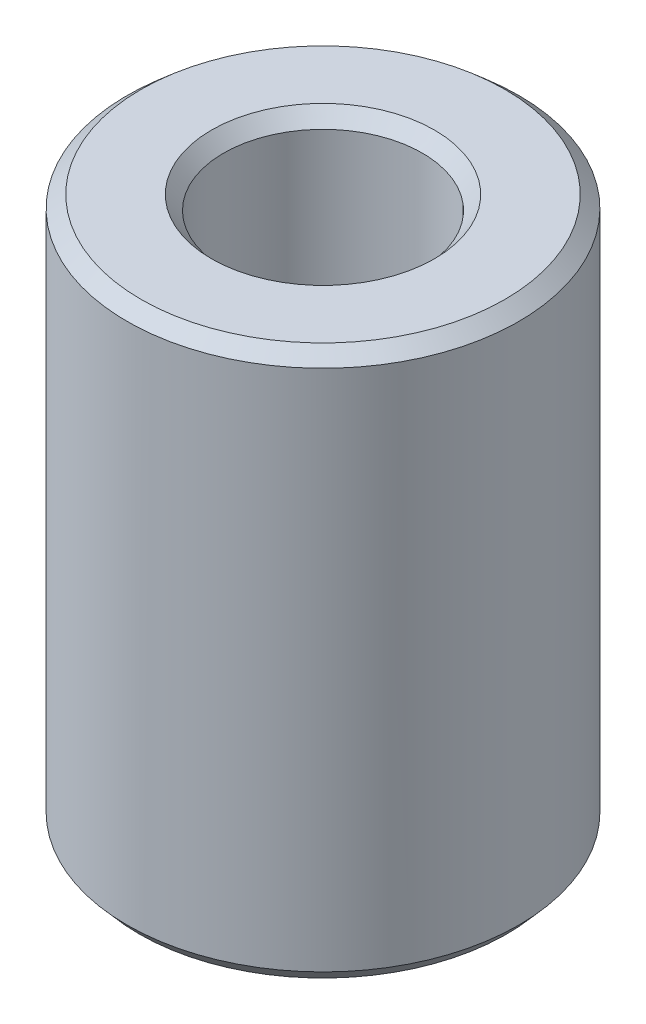
ISO-10303-21;
HEADER;
FILE_DESCRIPTION(('STEP AP214'),'2;1');
FILE_NAME('part.step','',(''),(''),'','','');
FILE_SCHEMA(('AUTOMOTIVE_DESIGN { 1 0 10303 214 1 1 1 1 }'));
ENDSEC;
DATA;
#1=APPLICATION_CONTEXT('core data for automotive mechanical design processes');
#2=APPLICATION_PROTOCOL_DEFINITION('international standard','automotive_design',2000,#1);
#3=PRODUCT_CONTEXT('',#1,'mechanical');
#4=PRODUCT('Part','Part','',(#3));
#5=PRODUCT_RELATED_PRODUCT_CATEGORY('part','',(#4));
#6=PRODUCT_DEFINITION_FORMATION('','',#4);
#7=PRODUCT_DEFINITION_CONTEXT('part definition',#1,'design');
#8=PRODUCT_DEFINITION('design','',#6,#7);
#9=PRODUCT_DEFINITION_SHAPE('','',#8);
#10=(LENGTH_UNIT() NAMED_UNIT(*) SI_UNIT(.MILLI.,.METRE.));
#11=(NAMED_UNIT(*) PLANE_ANGLE_UNIT() SI_UNIT($,.RADIAN.));
#12=(NAMED_UNIT(*) SI_UNIT($,.STERADIAN.) SOLID_ANGLE_UNIT());
#13=UNCERTAINTY_MEASURE_WITH_UNIT(LENGTH_MEASURE(1.E-05),#10,'distance_accuracy_value','');
#14=(GEOMETRIC_REPRESENTATION_CONTEXT(3) GLOBAL_UNCERTAINTY_ASSIGNED_CONTEXT((#13)) GLOBAL_UNIT_ASSIGNED_CONTEXT((#10,
#11,#12)) REPRESENTATION_CONTEXT('',''));
#15=CARTESIAN_POINT('',(0.,0.,0.));
#16=DIRECTION('',(0.,0.,1.));
#17=DIRECTION('',(1.,0.,0.));
#18=AXIS2_PLACEMENT_3D('',#15,#16,#17);
#19=CARTESIAN_POINT('',(0.,126.122248726224,0.));
#20=DIRECTION('',(0.,-1.,0.));
#21=DIRECTION('',(0.,0.,-1.));
#22=AXIS2_PLACEMENT_3D('',#19,#20,#21);
#23=CYLINDRICAL_SURFACE('',#22,45.);
#24=CARTESIAN_POINT('',(0.,3.19014125019523,0.));
#25=DIRECTION('',(0.,1.,0.));
#26=DIRECTION('',(0.,0.,1.));
#27=AXIS2_PLACEMENT_3D('',#24,#25,#26);
#28=CIRCLE('',#27,45.);
#29=CARTESIAN_POINT('',(0.,3.19014125019523,-45.));
#30=VERTEX_POINT('',#29);
#31=EDGE_CURVE('E10',#30,#30,#28,.T.);
#32=CARTESIAN_POINT('',(0.,123.332886154185,0.));
#33=DIRECTION('',(0.,1.,0.));
#34=DIRECTION('',(0.,0.,1.));
#35=AXIS2_PLACEMENT_3D('',#32,#33,#34);
#36=CIRCLE('',#35,45.);
#37=CARTESIAN_POINT('',(0.,123.332886154185,-45.));
#38=VERTEX_POINT('',#37);
#39=EDGE_CURVE('E50',#38,#38,#36,.F.);
#40=CARTESIAN_POINT('',(0.,3.19014125019523,-45.));
#41=CARTESIAN_POINT('',(0.,4.44162817627845,-45.));
#42=CARTESIAN_POINT('',(0.,5.69311510236167,-45.));
#43=CARTESIAN_POINT('',(0.,8.19608895452812,-45.));
#44=CARTESIAN_POINT('',(0.,9.44757588061134,-45.));
#45=CARTESIAN_POINT('',(0.,11.9505497327778,-45.));
#46=CARTESIAN_POINT('',(0.,13.202036658861,-45.));
#47=CARTESIAN_POINT('',(0.,15.7050105110275,-45.));
#48=CARTESIAN_POINT('',(0.,16.9564974371107,-45.));
#49=CARTESIAN_POINT('',(0.,19.4594712892771,-45.));
#50=CARTESIAN_POINT('',(0.,20.7109582153603,-45.));
#51=CARTESIAN_POINT('',(0.,23.2139320675268,-45.));
#52=CARTESIAN_POINT('',(0.,24.46541899361,-45.));
#53=CARTESIAN_POINT('',(0.,26.9683928457764,-45.));
#54=CARTESIAN_POINT('',(0.,28.2198797718597,-45.));
#55=CARTESIAN_POINT('',(0.,30.7228536240261,-45.));
#56=CARTESIAN_POINT('',(0.,31.9743405501093,-45.));
#57=CARTESIAN_POINT('',(0.,34.4773144022758,-45.));
#58=CARTESIAN_POINT('',(0.,35.728801328359,-45.));
#59=CARTESIAN_POINT('',(0.,38.2317751805255,-45.));
#60=CARTESIAN_POINT('',(0.,39.4832621066087,-45.));
#61=CARTESIAN_POINT('',(0.,41.9862359587751,-45.));
#62=CARTESIAN_POINT('',(0.,43.2377228848583,-45.));
#63=CARTESIAN_POINT('',(0.,45.7406967370248,-45.));
#64=CARTESIAN_POINT('',(0.,46.992183663108,-45.));
#65=CARTESIAN_POINT('',(0.,49.4951575152744,-45.));
#66=CARTESIAN_POINT('',(0.,50.7466444413577,-45.));
#67=CARTESIAN_POINT('',(0.,53.2496182935241,-45.));
#68=CARTESIAN_POINT('',(0.,54.5011052196073,-45.));
#69=CARTESIAN_POINT('',(0.,57.0040790717738,-45.));
#70=CARTESIAN_POINT('',(0.,58.255565997857,-45.));
#71=CARTESIAN_POINT('',(0.,60.7585398500235,-45.));
#72=CARTESIAN_POINT('',(0.,62.0100267761067,-45.));
#73=CARTESIAN_POINT('',(0.,64.5130006282731,-45.));
#74=CARTESIAN_POINT('',(0.,65.7644875543563,-45.));
#75=CARTESIAN_POINT('',(0.,68.2674614065228,-45.));
#76=CARTESIAN_POINT('',(0.,69.518948332606,-45.));
#77=CARTESIAN_POINT('',(0.,72.0219221847724,-45.));
#78=CARTESIAN_POINT('',(0.,73.2734091108557,-45.));
#79=CARTESIAN_POINT('',(0.,75.7763829630221,-45.));
#80=CARTESIAN_POINT('',(0.,77.0278698891053,-45.));
#81=CARTESIAN_POINT('',(0.,79.5308437412718,-45.));
#82=CARTESIAN_POINT('',(0.,80.782330667355,-45.));
#83=CARTESIAN_POINT('',(0.,83.2853045195214,-45.));
#84=CARTESIAN_POINT('',(0.,84.5367914456047,-45.));
#85=CARTESIAN_POINT('',(0.,87.0397652977711,-45.));
#86=CARTESIAN_POINT('',(0.,88.2912522238543,-45.));
#87=CARTESIAN_POINT('',(0.,90.7942260760208,-45.));
#88=CARTESIAN_POINT('',(0.,92.045713002104,-45.));
#89=CARTESIAN_POINT('',(0.,94.5486868542704,-45.));
#90=CARTESIAN_POINT('',(0.,95.8001737803537,-45.));
#91=CARTESIAN_POINT('',(0.,98.3031476325201,-45.));
#92=CARTESIAN_POINT('',(0.,99.5546345586033,-45.));
#93=CARTESIAN_POINT('',(0.,102.05760841077,-45.));
#94=CARTESIAN_POINT('',(0.,103.309095336853,-45.));
#95=CARTESIAN_POINT('',(0.,105.812069189019,-45.));
#96=CARTESIAN_POINT('',(0.,107.063556115103,-45.));
#97=CARTESIAN_POINT('',(0.,109.566529967269,-45.));
#98=CARTESIAN_POINT('',(0.,110.818016893352,-45.));
#99=CARTESIAN_POINT('',(0.,113.320990745519,-45.));
#100=CARTESIAN_POINT('',(0.,114.572477671602,-45.));
#101=CARTESIAN_POINT('',(0.,117.075451523768,-45.));
#102=CARTESIAN_POINT('',(0.,118.326938449852,-45.));
#103=CARTESIAN_POINT('',(0.,120.829912302018,-45.));
#104=CARTESIAN_POINT('',(0.,122.081399228101,-45.));
#105=CARTESIAN_POINT('',(0.,123.332886154185,-45.));
#106=B_SPLINE_CURVE_WITH_KNOTS('',3,(#40,#41,#42,#43,#44,#45,#46,#47,#48,#49,#50,#51,#52,#53,
#54,#55,#56,#57,#58,#59,#60,#61,#62,#63,#64,#65,#66,#67,#68,#69,#70,#71,#72,#73,#74,#75,#76,#77,
#78,#79,#80,#81,#82,#83,#84,#85,#86,#87,#88,#89,#90,#91,#92,#93,#94,#95,#96,#97,#98,#99,#100,
#101,#102,#103,#104,#105),.UNSPECIFIED.,.F.,.F.,(4,2,2,2,2,2,2,2,2,2,2,2,2,2,2,2,2,2,2,2,2,2,2,
2,2,2,2,2,2,2,2,2,4),(0.,3.75446077824966,7.50892155649933,11.263382334749,15.0178431129987,
18.7723038912483,22.526764669498,26.2812254477477,30.0356862259973,33.790147004247,
37.5446077824967,41.2990685607463,45.053529338996,48.8079901172457,52.5624508954953,
56.316911673745,60.0713724519947,63.8258332302443,67.580294008494,71.3347547867437,
75.0892155649933,78.843676343243,82.5981371214927,86.3525978997423,90.107058677992,
93.8615194562417,97.6159802344913,101.370441012741,105.124901790991,108.87936256924,
112.63382334749,116.38828412574,120.142744903989),.UNSPECIFIED.);
#107=EDGE_CURVE('BSEAM39',#30,#38,#106,.T.);
#108=ORIENTED_EDGE('',*,*,#31,.T.);
#109=ORIENTED_EDGE('',*,*,#39,.T.);
#110=ORIENTED_EDGE('',*,*,#107,.T.);
#111=ORIENTED_EDGE('',*,*,#107,.F.);
#112=EDGE_LOOP('',(#108,#110,#109,#111));
#113=FACE_BOUND('',#112,.T.);
#114=ADVANCED_FACE('F39',(#113),#23,.T.);
#115=CARTESIAN_POINT('',(0.,126.122248726224,0.));
#116=DIRECTION('',(0.,1.,0.));
#117=DIRECTION('',(0.,0.,1.));
#118=AXIS2_PLACEMENT_3D('',#115,#116,#117);
#119=PLANE('',#118);
#120=CARTESIAN_POINT('',(0.,126.122248726224,0.));
#121=DIRECTION('',(0.,1.,0.));
#122=DIRECTION('',(0.,0.,1.));
#123=AXIS2_PLACEMENT_3D('',#120,#121,#122);
#124=CIRCLE('',#123,25.6319341830347);
#125=CARTESIAN_POINT('',(0.,126.122248726224,25.6319341830347));
#126=VERTEX_POINT('',#125);
#127=EDGE_CURVE('E58',#126,#126,#124,.F.);
#128=ORIENTED_EDGE('',*,*,#127,.T.);
#129=EDGE_LOOP('',(#128));
#130=FACE_BOUND('',#129,.T.);
#131=CARTESIAN_POINT('',(0.,126.122248726224,0.));
#132=DIRECTION('',(0.,1.,0.));
#133=DIRECTION('',(0.,0.,1.));
#134=AXIS2_PLACEMENT_3D('',#131,#132,#133);
#135=CIRCLE('',#134,41.8098587498047);
#136=CARTESIAN_POINT('',(0.,126.122248726224,-41.8098587498047));
#137=VERTEX_POINT('',#136);
#138=EDGE_CURVE('E61',#137,#137,#135,.T.);
#139=ORIENTED_EDGE('',*,*,#138,.T.);
#140=EDGE_LOOP('',(#139));
#141=FACE_BOUND('',#140,.T.);
#142=ADVANCED_FACE('F88',(#130,#141),#119,.T.);
#143=CARTESIAN_POINT('',(0.,0.,0.));
#144=DIRECTION('',(0.,1.,0.));
#145=DIRECTION('',(0.,0.,1.));
#146=AXIS2_PLACEMENT_3D('',#143,#144,#145);
#147=PLANE('',#146);
#148=CARTESIAN_POINT('',(0.,0.,0.));
#149=DIRECTION('',(0.,1.,0.));
#150=DIRECTION('',(0.,0.,1.));
#151=AXIS2_PLACEMENT_3D('',#148,#149,#150);
#152=CIRCLE('',#151,26.032712861191);
#153=CARTESIAN_POINT('',(0.,0.,26.032712861191));
#154=VERTEX_POINT('',#153);
#155=EDGE_CURVE('E51',#154,#154,#152,.T.);
#156=ORIENTED_EDGE('',*,*,#155,.T.);
#157=EDGE_LOOP('',(#156));
#158=FACE_BOUND('',#157,.T.);
#159=CARTESIAN_POINT('',(0.,0.,0.));
#160=DIRECTION('',(0.,1.,0.));
#161=DIRECTION('',(0.,0.,1.));
#162=AXIS2_PLACEMENT_3D('',#159,#160,#161);
#163=CIRCLE('',#162,42.2106374279611);
#164=CARTESIAN_POINT('',(0.,0.,42.2106374279611));
#165=VERTEX_POINT('',#164);
#166=EDGE_CURVE('E54',#165,#165,#163,.F.);
#167=ORIENTED_EDGE('',*,*,#166,.T.);
#168=EDGE_LOOP('',(#167));
#169=FACE_BOUND('',#168,.T.);
#170=ADVANCED_FACE('F83',(#158,#169),#147,.F.);
#171=CARTESIAN_POINT('',(0.,126.122248726224,0.));
#172=DIRECTION('',(0.,-1.,0.));
#173=DIRECTION('',(0.,0.,-1.));
#174=AXIS2_PLACEMENT_3D('',#171,#172,#173);
#175=CYLINDRICAL_SURFACE('',#174,22.8425716109957);
#176=CARTESIAN_POINT('',(0.,122.932107476028,0.));
#177=DIRECTION('',(0.,1.,0.));
#178=DIRECTION('',(0.,0.,1.));
#179=AXIS2_PLACEMENT_3D('',#176,#177,#178);
#180=CIRCLE('',#179,22.8425716109957);
#181=CARTESIAN_POINT('',(0.,122.932107476028,22.8425716109957));
#182=VERTEX_POINT('',#181);
#183=EDGE_CURVE('E67',#182,#182,#180,.T.);
#184=ORIENTED_EDGE('',*,*,#183,.T.);
#185=EDGE_LOOP('',(#184));
#186=FACE_BOUND('',#185,.T.);
#187=CARTESIAN_POINT('',(0.,2.78936257203898,0.));
#188=DIRECTION('',(0.,1.,0.));
#189=DIRECTION('',(0.,0.,1.));
#190=AXIS2_PLACEMENT_3D('',#187,#188,#189);
#191=CIRCLE('',#190,22.8425716109957);
#192=CARTESIAN_POINT('',(0.,2.78936257203898,22.8425716109957));
#193=VERTEX_POINT('',#192);
#194=EDGE_CURVE('E69',#193,#193,#191,.F.);
#195=ORIENTED_EDGE('',*,*,#194,.T.);
#196=EDGE_LOOP('',(#195));
#197=FACE_BOUND('',#196,.T.);
#198=ADVANCED_FACE('F71',(#186,#197),#175,.F.);
#199=CARTESIAN_POINT('',(0.,122.932107476028,0.));
#200=DIRECTION('',(0.,1.,0.));
#201=DIRECTION('',(0.,0.,1.));
#202=AXIS2_PLACEMENT_3D('',#199,#200,#201);
#203=CONICAL_SURFACE('',#202,22.8425716109957,0.718472855018402);
#204=ORIENTED_EDGE('',*,*,#127,.F.);
#205=EDGE_LOOP('',(#204));
#206=FACE_BOUND('',#205,.T.);
#207=ORIENTED_EDGE('',*,*,#183,.F.);
#208=EDGE_LOOP('',(#207));
#209=FACE_BOUND('',#208,.T.);
#210=ADVANCED_FACE('F77',(#206,#209),#203,.F.);
#211=CARTESIAN_POINT('',(0.,0.,0.));
#212=DIRECTION('',(0.,-1.,0.));
#213=DIRECTION('',(0.,0.,-1.));
#214=AXIS2_PLACEMENT_3D('',#211,#212,#213);
#215=CONICAL_SURFACE('',#214,26.032712861191,0.852323471776488);
#216=ORIENTED_EDGE('',*,*,#194,.F.);
#217=EDGE_LOOP('',(#216));
#218=FACE_BOUND('',#217,.T.);
#219=ORIENTED_EDGE('',*,*,#155,.F.);
#220=EDGE_LOOP('',(#219));
#221=FACE_BOUND('',#220,.T.);
#222=ADVANCED_FACE('F73',(#218,#221),#215,.F.);
#223=CARTESIAN_POINT('',(0.,3.19014125019523,0.));
#224=DIRECTION('',(0.,1.,0.));
#225=DIRECTION('',(0.,0.,1.));
#226=AXIS2_PLACEMENT_3D('',#223,#224,#225);
#227=CONICAL_SURFACE('',#226,45.,0.718472855018406);
#228=ORIENTED_EDGE('',*,*,#166,.F.);
#229=EDGE_LOOP('',(#228));
#230=FACE_BOUND('',#229,.T.);
#231=ORIENTED_EDGE('',*,*,#31,.F.);
#232=EDGE_LOOP('',(#231));
#233=FACE_BOUND('',#232,.T.);
#234=ADVANCED_FACE('F76',(#230,#233),#227,.T.);
#235=CARTESIAN_POINT('',(0.,126.122248726224,0.));
#236=DIRECTION('',(0.,-1.,0.));
#237=DIRECTION('',(0.,0.,-1.));
#238=AXIS2_PLACEMENT_3D('',#235,#236,#237);
#239=CONICAL_SURFACE('',#238,41.8098587498047,0.852323471776497);
#240=CARTESIAN_POINT('',(0.,123.332886154185,-45.));
#241=CARTESIAN_POINT('',(0.,123.36194201431,-44.9667693619771));
#242=CARTESIAN_POINT('',(0.,123.390997874435,-44.9335387239543));
#243=CARTESIAN_POINT('',(0.,123.449109594686,-44.8670774479085));
#244=CARTESIAN_POINT('',(0.,123.478165454812,-44.8338468098857));
#245=CARTESIAN_POINT('',(0.,123.536277175062,-44.7673855338399));
#246=CARTESIAN_POINT('',(0.,123.565333035188,-44.7341548958171));
#247=CARTESIAN_POINT('',(0.,123.623444755439,-44.6676936197713));
#248=CARTESIAN_POINT('',(0.,123.652500615564,-44.6344629817485));
#249=CARTESIAN_POINT('',(0.,123.710612335815,-44.5680017057027));
#250=CARTESIAN_POINT('',(0.,123.73966819594,-44.5347710676799));
#251=CARTESIAN_POINT('',(0.,123.797779916191,-44.4683097916341));
#252=CARTESIAN_POINT('',(0.,123.826835776316,-44.4350791536113));
#253=CARTESIAN_POINT('',(0.,123.884947496567,-44.3686178775655));
#254=CARTESIAN_POINT('',(0.,123.914003356693,-44.3353872395427));
#255=CARTESIAN_POINT('',(0.,123.972115076943,-44.2689259634969));
#256=CARTESIAN_POINT('',(0.,124.001170937069,-44.2356953254741));
#257=CARTESIAN_POINT('',(0.,124.05928265732,-44.1692340494283));
#258=CARTESIAN_POINT('',(0.,124.088338517445,-44.1360034114055));
#259=CARTESIAN_POINT('',(0.,124.146450237696,-44.0695421353597));
#260=CARTESIAN_POINT('',(0.,124.175506097821,-44.0363114973368));
#261=CARTESIAN_POINT('',(0.,124.233617818072,-43.9698502212911));
#262=CARTESIAN_POINT('',(0.,124.262673678198,-43.9366195832682));
#263=CARTESIAN_POINT('',(0.,124.320785398448,-43.8701583072225));
#264=CARTESIAN_POINT('',(0.,124.349841258574,-43.8369276691996));
#265=CARTESIAN_POINT('',(0.,124.407952978825,-43.7704663931539));
#266=CARTESIAN_POINT('',(0.,124.43700883895,-43.737235755131));
#267=CARTESIAN_POINT('',(0.,124.495120559201,-43.6707744790853));
#268=CARTESIAN_POINT('',(0.,124.524176419326,-43.6375438410624));
#269=CARTESIAN_POINT('',(0.,124.582288139577,-43.5710825650167));
#270=CARTESIAN_POINT('',(0.,124.611343999702,-43.5378519269938));
#271=CARTESIAN_POINT('',(0.,124.669455719953,-43.4713906509481));
#272=CARTESIAN_POINT('',(0.,124.698511580079,-43.4381600129252));
#273=CARTESIAN_POINT('',(0.,124.756623300329,-43.3716987368795));
#274=CARTESIAN_POINT('',(0.,124.785679160455,-43.3384680988566));
#275=CARTESIAN_POINT('',(0.,124.843790880706,-43.2720068228109));
#276=CARTESIAN_POINT('',(0.,124.872846740831,-43.238776184788));
#277=CARTESIAN_POINT('',(0.,124.930958461082,-43.1723149087423));
#278=CARTESIAN_POINT('',(0.,124.960014321207,-43.1390842707194));
#279=CARTESIAN_POINT('',(0.,125.018126041458,-43.0726229946737));
#280=CARTESIAN_POINT('',(0.,125.047181901583,-43.0393923566508));
#281=CARTESIAN_POINT('',(0.,125.105293621834,-42.9729310806051));
#282=CARTESIAN_POINT('',(0.,125.13434948196,-42.9397004425822));
#283=CARTESIAN_POINT('',(0.,125.192461202211,-42.8732391665365));
#284=CARTESIAN_POINT('',(0.,125.221517062336,-42.8400085285136));
#285=CARTESIAN_POINT('',(0.,125.279628782587,-42.7735472524679));
#286=CARTESIAN_POINT('',(0.,125.308684642712,-42.740316614445));
#287=CARTESIAN_POINT('',(0.,125.366796362963,-42.6738553383993));
#288=CARTESIAN_POINT('',(0.,125.395852223088,-42.6406247003764));
#289=CARTESIAN_POINT('',(0.,125.453963943339,-42.5741634243307));
#290=CARTESIAN_POINT('',(0.,125.483019803465,-42.5409327863078));
#291=CARTESIAN_POINT('',(0.,125.541131523715,-42.4744715102621));
#292=CARTESIAN_POINT('',(0.,125.570187383841,-42.4412408722392));
#293=CARTESIAN_POINT('',(0.,125.628299104092,-42.3747795961935));
#294=CARTESIAN_POINT('',(0.,125.657354964217,-42.3415489581706));
#295=CARTESIAN_POINT('',(0.,125.715466684468,-42.2750876821249));
#296=CARTESIAN_POINT('',(0.,125.744522544593,-42.241857044102));
#297=CARTESIAN_POINT('',(0.,125.802634264844,-42.1753957680563));
#298=CARTESIAN_POINT('',(0.,125.831690124969,-42.1421651300334));
#299=CARTESIAN_POINT('',(0.,125.88980184522,-42.0757038539877));
#300=CARTESIAN_POINT('',(0.,125.918857705346,-42.0424732159648));
#301=CARTESIAN_POINT('',(0.,125.976969425596,-41.9760119399191));
#302=CARTESIAN_POINT('',(0.,126.006025285722,-41.9427813018962));
#303=CARTESIAN_POINT('',(0.,126.064137005973,-41.8763200258504));
#304=CARTESIAN_POINT('',(0.,126.093192866098,-41.8430893878276));
#305=CARTESIAN_POINT('',(0.,126.122248726224,-41.8098587498047));
#306=B_SPLINE_CURVE_WITH_KNOTS('',3,(#240,#241,#242,#243,#244,#245,#246,#247,#248,#249,#250,
#251,#252,#253,#254,#255,#256,#257,#258,#259,#260,#261,#262,#263,#264,#265,#266,#267,#268,#269,
#270,#271,#272,#273,#274,#275,#276,#277,#278,#279,#280,#281,#282,#283,#284,#285,#286,#287,#288,
#289,#290,#291,#292,#293,#294,#295,#296,#297,#298,#299,#300,#301,#302,#303,#304,#305),
.UNSPECIFIED.,.F.,.F.,(4,2,2,2,2,2,2,2,2,2,2,2,2,2,2,2,2,2,2,2,2,2,2,2,2,2,2,2,2,2,2,2,4),(0.,
0.132426072958855,0.264852145917715,0.397278218876579,0.529704291835444,0.662130364794309,
0.794556437753173,0.926982510712038,1.0594085836709,1.19183465662976,1.32426072958862,
1.45668680254748,1.58911287550635,1.72153894846521,1.85396502142407,1.98639109438293,
2.1188171673418,2.25124324030066,2.38366931325952,2.51609538621838,2.64852145917724,
2.78094753213611,2.91337360509497,3.04579967805383,3.1782257510127,3.31065182397156,
3.44307789693042,3.57550396988929,3.70793004284815,3.84035611580701,3.97278218876588,
4.10520826172474,4.23763433468361),.UNSPECIFIED.);
#307=EDGE_CURVE('BSEAM45',#38,#137,#306,.T.);
#308=ORIENTED_EDGE('',*,*,#39,.F.);
#309=ORIENTED_EDGE('',*,*,#138,.F.);
#310=ORIENTED_EDGE('',*,*,#307,.T.);
#311=ORIENTED_EDGE('',*,*,#307,.F.);
#312=EDGE_LOOP('',(#308,#310,#309,#311));
#313=FACE_BOUND('',#312,.T.);
#314=ADVANCED_FACE('F45',(#313),#239,.T.);
#315=CLOSED_SHELL('',(#114,#142,#170,#198,#210,#222,#234,#314));
#316=MANIFOLD_SOLID_BREP('B2',#315);
#317=ADVANCED_BREP_SHAPE_REPRESENTATION('',(#18,#316),#14);
#318=SHAPE_DEFINITION_REPRESENTATION(#9,#317);
ENDSEC;
END-ISO-10303-21;
